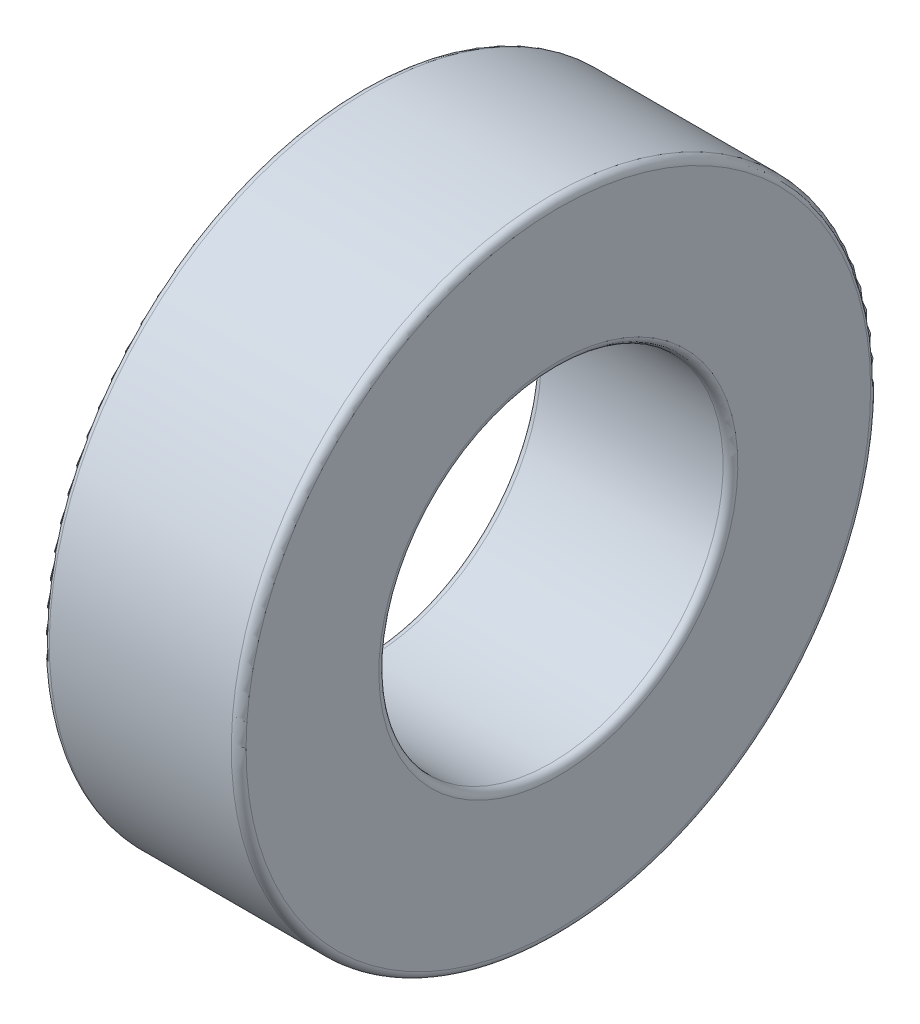
ISO-10303-21;
HEADER;
FILE_DESCRIPTION(('STEP AP214'),'2;1');
FILE_NAME('part.step','',(''),(''),'','','');
FILE_SCHEMA(('AUTOMOTIVE_DESIGN { 1 0 10303 214 1 1 1 1 }'));
ENDSEC;
DATA;
#1=APPLICATION_CONTEXT('core data for automotive mechanical design processes');
#2=APPLICATION_PROTOCOL_DEFINITION('international standard','automotive_design',2000,#1);
#3=PRODUCT_CONTEXT('',#1,'mechanical');
#4=PRODUCT('Part','Part','',(#3));
#5=PRODUCT_RELATED_PRODUCT_CATEGORY('part','',(#4));
#6=PRODUCT_DEFINITION_FORMATION('','',#4);
#7=PRODUCT_DEFINITION_CONTEXT('part definition',#1,'design');
#8=PRODUCT_DEFINITION('design','',#6,#7);
#9=PRODUCT_DEFINITION_SHAPE('','',#8);
#10=(LENGTH_UNIT() NAMED_UNIT(*) SI_UNIT(.MILLI.,.METRE.));
#11=(NAMED_UNIT(*) PLANE_ANGLE_UNIT() SI_UNIT($,.RADIAN.));
#12=(NAMED_UNIT(*) SI_UNIT($,.STERADIAN.) SOLID_ANGLE_UNIT());
#13=UNCERTAINTY_MEASURE_WITH_UNIT(LENGTH_MEASURE(1.E-05),#10,'distance_accuracy_value','');
#14=(GEOMETRIC_REPRESENTATION_CONTEXT(3) GLOBAL_UNCERTAINTY_ASSIGNED_CONTEXT((#13)) GLOBAL_UNIT_ASSIGNED_CONTEXT((#10,
#11,#12)) REPRESENTATION_CONTEXT('',''));
#15=CARTESIAN_POINT('',(0.,0.,0.));
#16=DIRECTION('',(0.,0.,1.));
#17=DIRECTION('',(1.,0.,0.));
#18=AXIS2_PLACEMENT_3D('',#15,#16,#17);
#19=CARTESIAN_POINT('',(0.,5.,0.));
#20=DIRECTION('',(-1.,0.,0.));
#21=DIRECTION('',(0.,-1.,0.));
#22=AXIS2_PLACEMENT_3D('',#19,#20,#21);
#23=PLANE('',#22);
#24=CARTESIAN_POINT('',(0.,0.,0.));
#25=DIRECTION('',(1.,0.,0.));
#26=DIRECTION('',(0.,1.,0.));
#27=AXIS2_PLACEMENT_3D('',#24,#25,#26);
#28=CIRCLE('',#27,6.35);
#29=CARTESIAN_POINT('',(0.,6.35,0.));
#30=VERTEX_POINT('',#29);
#31=EDGE_CURVE('E27',#30,#30,#28,.T.);
#32=ORIENTED_EDGE('',*,*,#31,.F.);
#33=EDGE_LOOP('',(#32));
#34=FACE_BOUND('',#33,.T.);
#35=CARTESIAN_POINT('',(0.,0.,0.));
#36=DIRECTION('',(1.,0.,0.));
#37=DIRECTION('',(0.,1.,0.));
#38=AXIS2_PLACEMENT_3D('',#35,#36,#37);
#39=CIRCLE('',#38,3.65);
#40=CARTESIAN_POINT('',(0.,3.65,0.));
#41=VERTEX_POINT('',#40);
#42=EDGE_CURVE('E11',#41,#41,#39,.T.);
#43=ORIENTED_EDGE('',*,*,#42,.T.);
#44=EDGE_LOOP('',(#43));
#45=FACE_BOUND('',#44,.T.);
#46=ADVANCED_FACE('F17',(#34,#45),#23,.T.);
#47=CARTESIAN_POINT('',(0.15,0.,0.));
#48=DIRECTION('',(1.,0.,0.));
#49=DIRECTION('',(0.,0.,-1.));
#50=AXIS2_PLACEMENT_3D('',#47,#48,#49);
#51=TOROIDAL_SURFACE('',#50,6.35,0.15);
#52=CARTESIAN_POINT('',(0.15,0.,0.));
#53=DIRECTION('',(1.,0.,0.));
#54=DIRECTION('',(0.,1.,0.));
#55=AXIS2_PLACEMENT_3D('',#52,#53,#54);
#56=CIRCLE('',#55,6.5);
#57=CARTESIAN_POINT('',(0.15,6.5,0.));
#58=VERTEX_POINT('',#57);
#59=EDGE_CURVE('E126',#58,#58,#56,.T.);
#60=ORIENTED_EDGE('',*,*,#59,.F.);
#61=EDGE_LOOP('',(#60));
#62=FACE_BOUND('',#61,.T.);
#63=ORIENTED_EDGE('',*,*,#31,.T.);
#64=EDGE_LOOP('',(#63));
#65=FACE_BOUND('',#64,.T.);
#66=ADVANCED_FACE('F158',(#62,#65),#51,.T.);
#67=CARTESIAN_POINT('',(2.,0.,0.));
#68=DIRECTION('',(-1.,0.,0.));
#69=DIRECTION('',(0.,1.,0.));
#70=AXIS2_PLACEMENT_3D('',#67,#68,#69);
#71=CYLINDRICAL_SURFACE('',#70,6.5);
#72=CARTESIAN_POINT('',(3.85,0.,0.));
#73=DIRECTION('',(1.,0.,0.));
#74=DIRECTION('',(0.,1.,0.));
#75=AXIS2_PLACEMENT_3D('',#72,#73,#74);
#76=CIRCLE('',#75,6.5);
#77=CARTESIAN_POINT('',(3.85,6.5,0.));
#78=VERTEX_POINT('',#77);
#79=EDGE_CURVE('E21',#78,#78,#76,.T.);
#80=ORIENTED_EDGE('',*,*,#79,.F.);
#81=EDGE_LOOP('',(#80));
#82=FACE_BOUND('',#81,.T.);
#83=ORIENTED_EDGE('',*,*,#59,.T.);
#84=EDGE_LOOP('',(#83));
#85=FACE_BOUND('',#84,.T.);
#86=ADVANCED_FACE('F163',(#82,#85),#71,.T.);
#87=CARTESIAN_POINT('',(3.85,0.,0.));
#88=DIRECTION('',(1.,0.,0.));
#89=DIRECTION('',(0.,0.,-1.));
#90=AXIS2_PLACEMENT_3D('',#87,#88,#89);
#91=TOROIDAL_SURFACE('',#90,6.35,0.15);
#92=CARTESIAN_POINT('',(4.,0.,0.));
#93=DIRECTION('',(1.,0.,0.));
#94=DIRECTION('',(0.,1.,0.));
#95=AXIS2_PLACEMENT_3D('',#92,#93,#94);
#96=CIRCLE('',#95,6.35);
#97=CARTESIAN_POINT('',(4.,6.35,0.));
#98=VERTEX_POINT('',#97);
#99=EDGE_CURVE('E109',#98,#98,#96,.T.);
#100=ORIENTED_EDGE('',*,*,#99,.F.);
#101=EDGE_LOOP('',(#100));
#102=FACE_BOUND('',#101,.T.);
#103=ORIENTED_EDGE('',*,*,#79,.T.);
#104=EDGE_LOOP('',(#103));
#105=FACE_BOUND('',#104,.T.);
#106=ADVANCED_FACE('F189',(#102,#105),#91,.T.);
#107=CARTESIAN_POINT('',(4.,5.,0.));
#108=DIRECTION('',(1.,0.,0.));
#109=DIRECTION('',(0.,1.,0.));
#110=AXIS2_PLACEMENT_3D('',#107,#108,#109);
#111=PLANE('',#110);
#112=CARTESIAN_POINT('',(4.,0.,0.));
#113=DIRECTION('',(1.,0.,0.));
#114=DIRECTION('',(0.,1.,0.));
#115=AXIS2_PLACEMENT_3D('',#112,#113,#114);
#116=CIRCLE('',#115,3.65);
#117=CARTESIAN_POINT('',(4.,3.65,0.));
#118=VERTEX_POINT('',#117);
#119=EDGE_CURVE('E75',#118,#118,#116,.T.);
#120=ORIENTED_EDGE('',*,*,#119,.F.);
#121=EDGE_LOOP('',(#120));
#122=FACE_BOUND('',#121,.T.);
#123=ORIENTED_EDGE('',*,*,#99,.T.);
#124=EDGE_LOOP('',(#123));
#125=FACE_BOUND('',#124,.T.);
#126=ADVANCED_FACE('F154',(#122,#125),#111,.T.);
#127=CARTESIAN_POINT('',(3.85,0.,0.));
#128=DIRECTION('',(1.,0.,0.));
#129=DIRECTION('',(0.,0.,-1.));
#130=AXIS2_PLACEMENT_3D('',#127,#128,#129);
#131=TOROIDAL_SURFACE('',#130,3.65,0.15);
#132=CARTESIAN_POINT('',(3.85,0.,0.));
#133=DIRECTION('',(1.,0.,0.));
#134=DIRECTION('',(0.,1.,0.));
#135=AXIS2_PLACEMENT_3D('',#132,#133,#134);
#136=CIRCLE('',#135,3.5);
#137=CARTESIAN_POINT('',(3.85,3.5,0.));
#138=VERTEX_POINT('',#137);
#139=EDGE_CURVE('E81',#138,#138,#136,.T.);
#140=ORIENTED_EDGE('',*,*,#139,.F.);
#141=EDGE_LOOP('',(#140));
#142=FACE_BOUND('',#141,.T.);
#143=ORIENTED_EDGE('',*,*,#119,.T.);
#144=EDGE_LOOP('',(#143));
#145=FACE_BOUND('',#144,.T.);
#146=ADVANCED_FACE('F144',(#142,#145),#131,.T.);
#147=CARTESIAN_POINT('',(2.,0.,0.));
#148=DIRECTION('',(-1.,0.,0.));
#149=DIRECTION('',(0.,1.,0.));
#150=AXIS2_PLACEMENT_3D('',#147,#148,#149);
#151=CYLINDRICAL_SURFACE('',#150,3.5);
#152=CARTESIAN_POINT('',(0.15,0.,0.));
#153=DIRECTION('',(1.,0.,0.));
#154=DIRECTION('',(0.,1.,0.));
#155=AXIS2_PLACEMENT_3D('',#152,#153,#154);
#156=CIRCLE('',#155,3.5);
#157=CARTESIAN_POINT('',(0.15,3.5,0.));
#158=VERTEX_POINT('',#157);
#159=EDGE_CURVE('E97',#158,#158,#156,.T.);
#160=ORIENTED_EDGE('',*,*,#159,.F.);
#161=EDGE_LOOP('',(#160));
#162=FACE_BOUND('',#161,.T.);
#163=ORIENTED_EDGE('',*,*,#139,.T.);
#164=EDGE_LOOP('',(#163));
#165=FACE_BOUND('',#164,.T.);
#166=ADVANCED_FACE('F141',(#162,#165),#151,.F.);
#167=CARTESIAN_POINT('',(0.15,0.,0.));
#168=DIRECTION('',(1.,0.,0.));
#169=DIRECTION('',(0.,0.,-1.));
#170=AXIS2_PLACEMENT_3D('',#167,#168,#169);
#171=TOROIDAL_SURFACE('',#170,3.65,0.15);
#172=ORIENTED_EDGE('',*,*,#42,.F.);
#173=EDGE_LOOP('',(#172));
#174=FACE_BOUND('',#173,.T.);
#175=ORIENTED_EDGE('',*,*,#159,.T.);
#176=EDGE_LOOP('',(#175));
#177=FACE_BOUND('',#176,.T.);
#178=ADVANCED_FACE('F143',(#174,#177),#171,.T.);
#179=CLOSED_SHELL('',(#46,#66,#86,#106,#126,#146,#166,#178));
#180=CARTESIAN_POINT('',(2.0675,-5.,0.));
#181=DIRECTION('',(1.,0.,0.));
#182=DIRECTION('',(0.,-1.,0.));
#183=AXIS2_PLACEMENT_3D('',#180,#181,#182);
#184=PLANE('',#183);
#185=CARTESIAN_POINT('',(2.0675,0.,0.));
#186=DIRECTION('',(1.,0.,0.));
#187=DIRECTION('',(0.,-1.,0.));
#188=AXIS2_PLACEMENT_3D('',#185,#186,#187);
#189=CIRCLE('',#188,4.9325);
#190=CARTESIAN_POINT('',(2.0675,4.9325,0.));
#191=VERTEX_POINT('',#190);
#192=EDGE_CURVE('E117',#191,#191,#189,.T.);
#193=ORIENTED_EDGE('',*,*,#192,.F.);
#194=EDGE_LOOP('',(#193));
#195=FACE_BOUND('',#194,.T.);
#196=CARTESIAN_POINT('',(2.0675,0.,0.));
#197=DIRECTION('',(1.,0.,0.));
#198=DIRECTION('',(0.,-1.,0.));
#199=AXIS2_PLACEMENT_3D('',#196,#197,#198);
#200=CIRCLE('',#199,4.5);
#201=CARTESIAN_POINT('',(2.0675,-4.5,0.));
#202=VERTEX_POINT('',#201);
#203=EDGE_CURVE('E94',#202,#202,#200,.T.);
#204=ORIENTED_EDGE('',*,*,#203,.T.);
#205=EDGE_LOOP('',(#204));
#206=FACE_BOUND('',#205,.T.);
#207=ADVANCED_FACE('F193',(#195,#206),#184,.F.);
#208=CARTESIAN_POINT('',(1.9325,-5.,0.));
#209=DIRECTION('',(-1.,0.,0.));
#210=DIRECTION('',(0.,1.,0.));
#211=AXIS2_PLACEMENT_3D('',#208,#209,#210);
#212=PLANE('',#211);
#213=CARTESIAN_POINT('',(1.9325,0.,0.));
#214=DIRECTION('',(-1.,0.,0.));
#215=DIRECTION('',(0.,-1.,0.));
#216=AXIS2_PLACEMENT_3D('',#213,#214,#215);
#217=CIRCLE('',#216,4.9325);
#218=CARTESIAN_POINT('',(1.9325,4.9325,0.));
#219=VERTEX_POINT('',#218);
#220=EDGE_CURVE('E121',#219,#219,#217,.T.);
#221=ORIENTED_EDGE('',*,*,#220,.F.);
#222=EDGE_LOOP('',(#221));
#223=FACE_BOUND('',#222,.T.);
#224=CARTESIAN_POINT('',(1.9325,0.,0.));
#225=DIRECTION('',(1.,0.,0.));
#226=DIRECTION('',(0.,-1.,0.));
#227=AXIS2_PLACEMENT_3D('',#224,#225,#226);
#228=CIRCLE('',#227,4.5);
#229=CARTESIAN_POINT('',(1.9325,-4.5,0.));
#230=VERTEX_POINT('',#229);
#231=EDGE_CURVE('E103',#230,#230,#228,.T.);
#232=ORIENTED_EDGE('',*,*,#231,.F.);
#233=EDGE_LOOP('',(#232));
#234=FACE_BOUND('',#233,.T.);
#235=ADVANCED_FACE('F174',(#223,#234),#212,.F.);
#236=CARTESIAN_POINT('',(2.,0.,0.));
#237=DIRECTION('',(-1.,0.,0.));
#238=DIRECTION('',(0.,-1.,0.));
#239=AXIS2_PLACEMENT_3D('',#236,#237,#238);
#240=CYLINDRICAL_SURFACE('',#239,5.5);
#241=CARTESIAN_POINT('',(2.0675,0.,0.));
#242=DIRECTION('',(1.,0.,0.));
#243=DIRECTION('',(0.,-1.,0.));
#244=AXIS2_PLACEMENT_3D('',#241,#242,#243);
#245=CIRCLE('',#244,5.5);
#246=CARTESIAN_POINT('',(2.0675,-5.5,0.));
#247=VERTEX_POINT('',#246);
#248=EDGE_CURVE('E98',#247,#247,#245,.T.);
#249=ORIENTED_EDGE('',*,*,#248,.T.);
#250=EDGE_LOOP('',(#249));
#251=FACE_BOUND('',#250,.T.);
#252=CARTESIAN_POINT('',(1.9325,0.,0.));
#253=DIRECTION('',(1.,0.,0.));
#254=DIRECTION('',(0.,-1.,0.));
#255=AXIS2_PLACEMENT_3D('',#252,#253,#254);
#256=CIRCLE('',#255,5.5);
#257=CARTESIAN_POINT('',(1.9325,-5.5,0.));
#258=VERTEX_POINT('',#257);
#259=EDGE_CURVE('E111',#258,#258,#256,.T.);
#260=ORIENTED_EDGE('',*,*,#259,.F.);
#261=EDGE_LOOP('',(#260));
#262=FACE_BOUND('',#261,.T.);
#263=ADVANCED_FACE('F171',(#251,#262),#240,.F.);
#264=CARTESIAN_POINT('',(2.0675,-5.,0.));
#265=DIRECTION('',(1.,0.,0.));
#266=DIRECTION('',(0.,-1.,0.));
#267=AXIS2_PLACEMENT_3D('',#264,#265,#266);
#268=PLANE('',#267);
#269=CARTESIAN_POINT('',(2.0675,0.,0.));
#270=DIRECTION('',(-1.,0.,0.));
#271=DIRECTION('',(0.,-1.,0.));
#272=AXIS2_PLACEMENT_3D('',#269,#270,#271);
#273=CIRCLE('',#272,5.0675);
#274=CARTESIAN_POINT('',(2.0675,5.0675,0.));
#275=VERTEX_POINT('',#274);
#276=EDGE_CURVE('E122',#275,#275,#273,.T.);
#277=ORIENTED_EDGE('',*,*,#276,.F.);
#278=EDGE_LOOP('',(#277));
#279=FACE_BOUND('',#278,.T.);
#280=ORIENTED_EDGE('',*,*,#248,.F.);
#281=EDGE_LOOP('',(#280));
#282=FACE_BOUND('',#281,.T.);
#283=ADVANCED_FACE('F173',(#279,#282),#268,.F.);
#284=CARTESIAN_POINT('',(2.,0.,0.));
#285=DIRECTION('',(-1.,0.,0.));
#286=DIRECTION('',(0.,-1.,0.));
#287=AXIS2_PLACEMENT_3D('',#284,#285,#286);
#288=CYLINDRICAL_SURFACE('',#287,4.5);
#289=ORIENTED_EDGE('',*,*,#231,.T.);
#290=EDGE_LOOP('',(#289));
#291=FACE_BOUND('',#290,.T.);
#292=ORIENTED_EDGE('',*,*,#203,.F.);
#293=EDGE_LOOP('',(#292));
#294=FACE_BOUND('',#293,.T.);
#295=ADVANCED_FACE('F95',(#291,#294),#288,.T.);
#296=CARTESIAN_POINT('',(1.9325,-5.,0.));
#297=DIRECTION('',(-1.,0.,0.));
#298=DIRECTION('',(0.,1.,0.));
#299=AXIS2_PLACEMENT_3D('',#296,#297,#298);
#300=PLANE('',#299);
#301=CARTESIAN_POINT('',(1.9325,0.,0.));
#302=DIRECTION('',(1.,0.,0.));
#303=DIRECTION('',(0.,-1.,0.));
#304=AXIS2_PLACEMENT_3D('',#301,#302,#303);
#305=CIRCLE('',#304,5.0675);
#306=CARTESIAN_POINT('',(1.9325,5.0675,0.));
#307=VERTEX_POINT('',#306);
#308=EDGE_CURVE('E107',#307,#307,#305,.T.);
#309=ORIENTED_EDGE('',*,*,#308,.F.);
#310=EDGE_LOOP('',(#309));
#311=FACE_BOUND('',#310,.T.);
#312=ORIENTED_EDGE('',*,*,#259,.T.);
#313=EDGE_LOOP('',(#312));
#314=FACE_BOUND('',#313,.T.);
#315=ADVANCED_FACE('F196',(#311,#314),#300,.F.);
#316=CARTESIAN_POINT('',(2.,0.,0.));
#317=DIRECTION('',(-1.,0.,0.));
#318=DIRECTION('',(0.,-1.,0.));
#319=AXIS2_PLACEMENT_3D('',#316,#317,#318);
#320=CYLINDRICAL_SURFACE('',#319,5.0675);
#321=ORIENTED_EDGE('',*,*,#308,.T.);
#322=EDGE_LOOP('',(#321));
#323=FACE_BOUND('',#322,.T.);
#324=CARTESIAN_POINT('',(0.75,0.,0.));
#325=DIRECTION('',(1.,0.,0.));
#326=DIRECTION('',(0.,-1.,0.));
#327=AXIS2_PLACEMENT_3D('',#324,#325,#326);
#328=CIRCLE('',#327,5.0675);
#329=CARTESIAN_POINT('',(0.75,-5.0675,0.));
#330=VERTEX_POINT('',#329);
#331=EDGE_CURVE('E114',#330,#330,#328,.T.);
#332=ORIENTED_EDGE('',*,*,#331,.F.);
#333=EDGE_LOOP('',(#332));
#334=FACE_BOUND('',#333,.T.);
#335=ADVANCED_FACE('F19',(#323,#334),#320,.F.);
#336=CARTESIAN_POINT('',(2.,0.,0.));
#337=DIRECTION('',(-1.,0.,0.));
#338=DIRECTION('',(0.,-1.,0.));
#339=AXIS2_PLACEMENT_3D('',#336,#337,#338);
#340=CYLINDRICAL_SURFACE('',#339,4.9325);
#341=ORIENTED_EDGE('',*,*,#220,.T.);
#342=EDGE_LOOP('',(#341));
#343=FACE_BOUND('',#342,.T.);
#344=CARTESIAN_POINT('',(0.75,0.,0.));
#345=DIRECTION('',(1.,0.,0.));
#346=DIRECTION('',(0.,-1.,0.));
#347=AXIS2_PLACEMENT_3D('',#344,#345,#346);
#348=CIRCLE('',#347,4.9325);
#349=CARTESIAN_POINT('',(0.75,-4.9325,0.));
#350=VERTEX_POINT('',#349);
#351=EDGE_CURVE('E118',#350,#350,#348,.T.);
#352=ORIENTED_EDGE('',*,*,#351,.T.);
#353=EDGE_LOOP('',(#352));
#354=FACE_BOUND('',#353,.T.);
#355=ADVANCED_FACE('F185',(#343,#354),#340,.T.);
#356=CARTESIAN_POINT('',(2.,0.,0.));
#357=DIRECTION('',(-1.,0.,0.));
#358=DIRECTION('',(0.,-1.,0.));
#359=AXIS2_PLACEMENT_3D('',#356,#357,#358);
#360=CYLINDRICAL_SURFACE('',#359,5.0675);
#361=ORIENTED_EDGE('',*,*,#276,.T.);
#362=EDGE_LOOP('',(#361));
#363=FACE_BOUND('',#362,.T.);
#364=CARTESIAN_POINT('',(3.25,0.,0.));
#365=DIRECTION('',(1.,0.,0.));
#366=DIRECTION('',(0.,-1.,0.));
#367=AXIS2_PLACEMENT_3D('',#364,#365,#366);
#368=CIRCLE('',#367,5.0675);
#369=CARTESIAN_POINT('',(3.25,-5.0675,0.));
#370=VERTEX_POINT('',#369);
#371=EDGE_CURVE('E129',#370,#370,#368,.T.);
#372=ORIENTED_EDGE('',*,*,#371,.T.);
#373=EDGE_LOOP('',(#372));
#374=FACE_BOUND('',#373,.T.);
#375=ADVANCED_FACE('F181',(#363,#374),#360,.F.);
#376=CARTESIAN_POINT('',(3.25,-5.,0.));
#377=DIRECTION('',(1.,0.,0.));
#378=DIRECTION('',(0.,-1.,0.));
#379=AXIS2_PLACEMENT_3D('',#376,#377,#378);
#380=PLANE('',#379);
#381=CARTESIAN_POINT('',(3.25,0.,0.));
#382=DIRECTION('',(1.,0.,0.));
#383=DIRECTION('',(0.,-1.,0.));
#384=AXIS2_PLACEMENT_3D('',#381,#382,#383);
#385=CIRCLE('',#384,4.9325);
#386=CARTESIAN_POINT('',(3.25,-4.9325,0.));
#387=VERTEX_POINT('',#386);
#388=EDGE_CURVE('E124',#387,#387,#385,.T.);
#389=ORIENTED_EDGE('',*,*,#388,.T.);
#390=EDGE_LOOP('',(#389));
#391=FACE_BOUND('',#390,.T.);
#392=ORIENTED_EDGE('',*,*,#371,.F.);
#393=EDGE_LOOP('',(#392));
#394=FACE_BOUND('',#393,.T.);
#395=ADVANCED_FACE('F184',(#391,#394),#380,.F.);
#396=CARTESIAN_POINT('',(2.,0.,0.));
#397=DIRECTION('',(-1.,0.,0.));
#398=DIRECTION('',(0.,-1.,0.));
#399=AXIS2_PLACEMENT_3D('',#396,#397,#398);
#400=CYLINDRICAL_SURFACE('',#399,4.9325);
#401=ORIENTED_EDGE('',*,*,#192,.T.);
#402=EDGE_LOOP('',(#401));
#403=FACE_BOUND('',#402,.T.);
#404=ORIENTED_EDGE('',*,*,#388,.F.);
#405=EDGE_LOOP('',(#404));
#406=FACE_BOUND('',#405,.T.);
#407=ADVANCED_FACE('F169',(#403,#406),#400,.T.);
#408=CARTESIAN_POINT('',(0.75,-5.,0.));
#409=DIRECTION('',(-1.,0.,0.));
#410=DIRECTION('',(0.,1.,0.));
#411=AXIS2_PLACEMENT_3D('',#408,#409,#410);
#412=PLANE('',#411);
#413=ORIENTED_EDGE('',*,*,#331,.T.);
#414=EDGE_LOOP('',(#413));
#415=FACE_BOUND('',#414,.T.);
#416=ORIENTED_EDGE('',*,*,#351,.F.);
#417=EDGE_LOOP('',(#416));
#418=FACE_BOUND('',#417,.T.);
#419=ADVANCED_FACE('F311',(#415,#418),#412,.F.);
#420=CLOSED_SHELL('',(#207,#235,#263,#283,#295,#315,#335,#355,#375,#395,#407,#419));
#421=ORIENTED_CLOSED_SHELL('',*,#179,.T.);
#422=BREP_WITH_VOIDS('B1',#420,(#421));
#423=ADVANCED_BREP_SHAPE_REPRESENTATION('',(#18,#422),#14);
#424=SHAPE_DEFINITION_REPRESENTATION(#9,#423);
ENDSEC;
END-ISO-10303-21;
